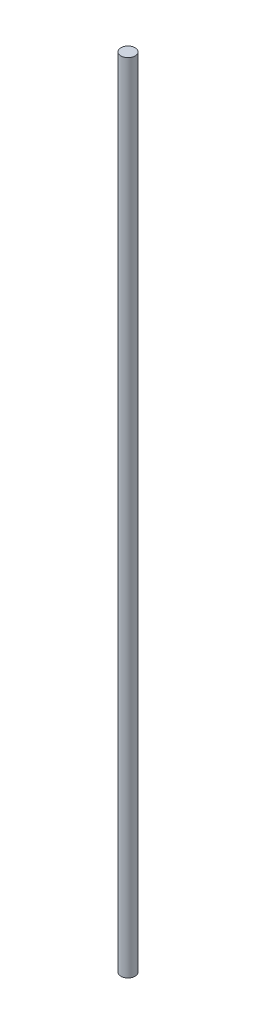
ISO-10303-21;
HEADER;
FILE_DESCRIPTION(('STEP AP214'),'2;1');
FILE_NAME('part.step','',(''),(''),'','','');
FILE_SCHEMA(('AUTOMOTIVE_DESIGN { 1 0 10303 214 1 1 1 1 }'));
ENDSEC;
DATA;
#1=APPLICATION_CONTEXT('core data for automotive mechanical design processes');
#2=APPLICATION_PROTOCOL_DEFINITION('international standard','automotive_design',2000,#1);
#3=PRODUCT_CONTEXT('',#1,'mechanical');
#4=PRODUCT('Part','Part','',(#3));
#5=PRODUCT_RELATED_PRODUCT_CATEGORY('part','',(#4));
#6=PRODUCT_DEFINITION_FORMATION('','',#4);
#7=PRODUCT_DEFINITION_CONTEXT('part definition',#1,'design');
#8=PRODUCT_DEFINITION('design','',#6,#7);
#9=PRODUCT_DEFINITION_SHAPE('','',#8);
#10=(LENGTH_UNIT() NAMED_UNIT(*) SI_UNIT(.MILLI.,.METRE.));
#11=(NAMED_UNIT(*) PLANE_ANGLE_UNIT() SI_UNIT($,.RADIAN.));
#12=(NAMED_UNIT(*) SI_UNIT($,.STERADIAN.) SOLID_ANGLE_UNIT());
#13=UNCERTAINTY_MEASURE_WITH_UNIT(LENGTH_MEASURE(1.E-05),#10,'distance_accuracy_value','');
#14=(GEOMETRIC_REPRESENTATION_CONTEXT(3) GLOBAL_UNCERTAINTY_ASSIGNED_CONTEXT((#13)) GLOBAL_UNIT_ASSIGNED_CONTEXT((#10,
#11,#12)) REPRESENTATION_CONTEXT('',''));
#15=CARTESIAN_POINT('',(0.,0.,0.));
#16=DIRECTION('',(0.,0.,1.));
#17=DIRECTION('',(1.,0.,0.));
#18=AXIS2_PLACEMENT_3D('',#15,#16,#17);
#19=CARTESIAN_POINT('',(0.,279.4,0.));
#20=DIRECTION('',(0.,-1.,0.));
#21=DIRECTION('',(0.,0.,-1.));
#22=AXIS2_PLACEMENT_3D('',#19,#20,#21);
#23=CYLINDRICAL_SURFACE('',#22,2.5);
#24=CARTESIAN_POINT('',(0.,279.4,0.));
#25=DIRECTION('',(0.,1.,0.));
#26=DIRECTION('',(0.,0.,1.));
#27=AXIS2_PLACEMENT_3D('',#24,#25,#26);
#28=CIRCLE('',#27,2.5);
#29=CARTESIAN_POINT('',(0.,279.4,2.5));
#30=VERTEX_POINT('',#29);
#31=EDGE_CURVE('E11',#30,#30,#28,.T.);
#32=ORIENTED_EDGE('',*,*,#31,.F.);
#33=EDGE_LOOP('',(#32));
#34=FACE_BOUND('',#33,.T.);
#35=CARTESIAN_POINT('',(0.,0.,0.));
#36=DIRECTION('',(0.,1.,0.));
#37=DIRECTION('',(0.,0.,1.));
#38=AXIS2_PLACEMENT_3D('',#35,#36,#37);
#39=CIRCLE('',#38,2.5);
#40=CARTESIAN_POINT('',(0.,0.,2.5));
#41=VERTEX_POINT('',#40);
#42=EDGE_CURVE('E44',#41,#41,#39,.T.);
#43=ORIENTED_EDGE('',*,*,#42,.T.);
#44=EDGE_LOOP('',(#43));
#45=FACE_BOUND('',#44,.T.);
#46=ADVANCED_FACE('F40',(#34,#45),#23,.T.);
#47=CARTESIAN_POINT('',(0.,279.4,0.));
#48=DIRECTION('',(0.,1.,0.));
#49=DIRECTION('',(0.,0.,1.));
#50=AXIS2_PLACEMENT_3D('',#47,#48,#49);
#51=PLANE('',#50);
#52=ORIENTED_EDGE('',*,*,#31,.T.);
#53=EDGE_LOOP('',(#52));
#54=FACE_BOUND('',#53,.T.);
#55=ADVANCED_FACE('F60',(#54),#51,.T.);
#56=CARTESIAN_POINT('',(0.,0.,0.));
#57=DIRECTION('',(0.,1.,0.));
#58=DIRECTION('',(0.,0.,1.));
#59=AXIS2_PLACEMENT_3D('',#56,#57,#58);
#60=PLANE('',#59);
#61=ORIENTED_EDGE('',*,*,#42,.F.);
#62=EDGE_LOOP('',(#61));
#63=FACE_BOUND('',#62,.T.);
#64=ADVANCED_FACE('F58',(#63),#60,.F.);
#65=CLOSED_SHELL('',(#46,#55,#64));
#66=MANIFOLD_SOLID_BREP('B2',#65);
#67=ADVANCED_BREP_SHAPE_REPRESENTATION('',(#18,#66),#14);
#68=SHAPE_DEFINITION_REPRESENTATION(#9,#67);
ENDSEC;
END-ISO-10303-21;
